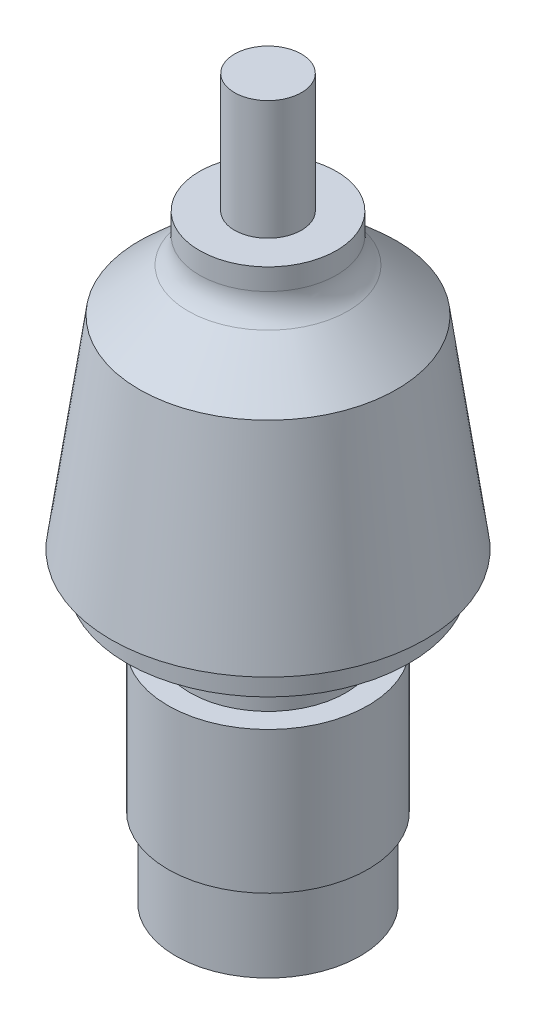
ISO-10303-21;
HEADER;
FILE_DESCRIPTION(('STEP AP214'),'2;1');
FILE_NAME('part.step','',(''),(''),'','','');
FILE_SCHEMA(('AUTOMOTIVE_DESIGN { 1 0 10303 214 1 1 1 1 }'));
ENDSEC;
DATA;
#1=APPLICATION_CONTEXT('core data for automotive mechanical design processes');
#2=APPLICATION_PROTOCOL_DEFINITION('international standard','automotive_design',2000,#1);
#3=PRODUCT_CONTEXT('',#1,'mechanical');
#4=PRODUCT('Part','Part','',(#3));
#5=PRODUCT_RELATED_PRODUCT_CATEGORY('part','',(#4));
#6=PRODUCT_DEFINITION_FORMATION('','',#4);
#7=PRODUCT_DEFINITION_CONTEXT('part definition',#1,'design');
#8=PRODUCT_DEFINITION('design','',#6,#7);
#9=PRODUCT_DEFINITION_SHAPE('','',#8);
#10=(LENGTH_UNIT() NAMED_UNIT(*) SI_UNIT(.MILLI.,.METRE.));
#11=(NAMED_UNIT(*) PLANE_ANGLE_UNIT() SI_UNIT($,.RADIAN.));
#12=(NAMED_UNIT(*) SI_UNIT($,.STERADIAN.) SOLID_ANGLE_UNIT());
#13=UNCERTAINTY_MEASURE_WITH_UNIT(LENGTH_MEASURE(1.E-05),#10,'distance_accuracy_value','');
#14=(GEOMETRIC_REPRESENTATION_CONTEXT(3) GLOBAL_UNCERTAINTY_ASSIGNED_CONTEXT((#13)) GLOBAL_UNIT_ASSIGNED_CONTEXT((#10,
#11,#12)) REPRESENTATION_CONTEXT('',''));
#15=CARTESIAN_POINT('',(0.,0.,0.));
#16=DIRECTION('',(0.,0.,1.));
#17=DIRECTION('',(1.,0.,0.));
#18=AXIS2_PLACEMENT_3D('',#15,#16,#17);
#19=CARTESIAN_POINT('',(0.,11.7856,0.));
#20=DIRECTION('',(0.,-1.,0.));
#21=DIRECTION('',(0.,0.,-1.));
#22=AXIS2_PLACEMENT_3D('',#19,#20,#21);
#23=CYLINDRICAL_SURFACE('',#22,13.7541);
#24=CARTESIAN_POINT('',(0.,11.7856,0.));
#25=DIRECTION('',(0.,1.,0.));
#26=DIRECTION('',(0.,0.,1.));
#27=AXIS2_PLACEMENT_3D('',#24,#25,#26);
#28=CIRCLE('',#27,13.7541);
#29=CARTESIAN_POINT('',(0.,11.7856,13.7541));
#30=VERTEX_POINT('',#29);
#31=EDGE_CURVE('E48',#30,#30,#28,.T.);
#32=ORIENTED_EDGE('',*,*,#31,.F.);
#33=EDGE_LOOP('',(#32));
#34=FACE_BOUND('',#33,.T.);
#35=CARTESIAN_POINT('',(0.,0.,0.));
#36=DIRECTION('',(0.,1.,0.));
#37=DIRECTION('',(0.,0.,1.));
#38=AXIS2_PLACEMENT_3D('',#35,#36,#37);
#39=CIRCLE('',#38,13.7541);
#40=CARTESIAN_POINT('',(0.,0.,13.7541));
#41=VERTEX_POINT('',#40);
#42=EDGE_CURVE('E52',#41,#41,#39,.T.);
#43=ORIENTED_EDGE('',*,*,#42,.T.);
#44=EDGE_LOOP('',(#43));
#45=FACE_BOUND('',#44,.T.);
#46=ADVANCED_FACE('F37',(#34,#45),#23,.T.);
#47=CARTESIAN_POINT('',(0.,0.,0.));
#48=DIRECTION('',(0.,1.,0.));
#49=DIRECTION('',(0.,0.,1.));
#50=AXIS2_PLACEMENT_3D('',#47,#48,#49);
#51=PLANE('',#50);
#52=ORIENTED_EDGE('',*,*,#42,.F.);
#53=EDGE_LOOP('',(#52));
#54=FACE_BOUND('',#53,.T.);
#55=ADVANCED_FACE('F115',(#54),#51,.F.);
#56=CARTESIAN_POINT('',(0.,32.9438,0.));
#57=DIRECTION('',(0.,-1.,0.));
#58=DIRECTION('',(0.,0.,-1.));
#59=AXIS2_PLACEMENT_3D('',#56,#57,#58);
#60=CYLINDRICAL_SURFACE('',#59,14.9225);
#61=CARTESIAN_POINT('',(0.,32.9438,0.));
#62=DIRECTION('',(0.,1.,0.));
#63=DIRECTION('',(0.,0.,1.));
#64=AXIS2_PLACEMENT_3D('',#61,#62,#63);
#65=CIRCLE('',#64,14.9225);
#66=CARTESIAN_POINT('',(0.,32.9438,14.9225));
#67=VERTEX_POINT('',#66);
#68=EDGE_CURVE('E56',#67,#67,#65,.T.);
#69=ORIENTED_EDGE('',*,*,#68,.F.);
#70=EDGE_LOOP('',(#69));
#71=FACE_BOUND('',#70,.T.);
#72=CARTESIAN_POINT('',(0.,11.7856,0.));
#73=DIRECTION('',(0.,1.,0.));
#74=DIRECTION('',(0.,0.,1.));
#75=AXIS2_PLACEMENT_3D('',#72,#73,#74);
#76=CIRCLE('',#75,14.9225);
#77=CARTESIAN_POINT('',(0.,11.7856,14.9225));
#78=VERTEX_POINT('',#77);
#79=EDGE_CURVE('E58',#78,#78,#76,.T.);
#80=ORIENTED_EDGE('',*,*,#79,.T.);
#81=EDGE_LOOP('',(#80));
#82=FACE_BOUND('',#81,.T.);
#83=ADVANCED_FACE('F120',(#71,#82),#60,.T.);
#84=CARTESIAN_POINT('',(0.,32.9438,0.));
#85=DIRECTION('',(0.,1.,0.));
#86=DIRECTION('',(0.,0.,1.));
#87=AXIS2_PLACEMENT_3D('',#84,#85,#86);
#88=PLANE('',#87);
#89=CARTESIAN_POINT('',(0.,32.9438,0.));
#90=DIRECTION('',(0.,1.,0.));
#91=DIRECTION('',(0.,0.,1.));
#92=AXIS2_PLACEMENT_3D('',#89,#90,#91);
#93=CIRCLE('',#92,11.6205);
#94=CARTESIAN_POINT('',(0.,32.9438,11.6205));
#95=VERTEX_POINT('',#94);
#96=EDGE_CURVE('E64',#95,#95,#93,.T.);
#97=ORIENTED_EDGE('',*,*,#96,.F.);
#98=EDGE_LOOP('',(#97));
#99=FACE_BOUND('',#98,.T.);
#100=ORIENTED_EDGE('',*,*,#68,.T.);
#101=EDGE_LOOP('',(#100));
#102=FACE_BOUND('',#101,.T.);
#103=ADVANCED_FACE('F128',(#99,#102),#88,.T.);
#104=CARTESIAN_POINT('',(0.,11.7856,0.));
#105=DIRECTION('',(0.,1.,0.));
#106=DIRECTION('',(0.,0.,1.));
#107=AXIS2_PLACEMENT_3D('',#104,#105,#106);
#108=PLANE('',#107);
#109=ORIENTED_EDGE('',*,*,#31,.T.);
#110=EDGE_LOOP('',(#109));
#111=FACE_BOUND('',#110,.T.);
#112=ORIENTED_EDGE('',*,*,#79,.F.);
#113=EDGE_LOOP('',(#112));
#114=FACE_BOUND('',#113,.T.);
#115=ADVANCED_FACE('F130',(#111,#114),#108,.F.);
#116=CARTESIAN_POINT('',(0.,41.5036,0.));
#117=DIRECTION('',(0.,-1.,0.));
#118=DIRECTION('',(0.,0.,-1.));
#119=AXIS2_PLACEMENT_3D('',#116,#117,#118);
#120=CYLINDRICAL_SURFACE('',#119,11.6205);
#121=CARTESIAN_POINT('',(0.,41.5036,0.));
#122=DIRECTION('',(0.,1.,0.));
#123=DIRECTION('',(0.,0.,1.));
#124=AXIS2_PLACEMENT_3D('',#121,#122,#123);
#125=CIRCLE('',#124,11.6205);
#126=CARTESIAN_POINT('',(0.,41.5036,11.6205));
#127=VERTEX_POINT('',#126);
#128=EDGE_CURVE('E61',#127,#127,#125,.T.);
#129=ORIENTED_EDGE('',*,*,#128,.F.);
#130=EDGE_LOOP('',(#129));
#131=FACE_BOUND('',#130,.T.);
#132=ORIENTED_EDGE('',*,*,#96,.T.);
#133=EDGE_LOOP('',(#132));
#134=FACE_BOUND('',#133,.T.);
#135=ADVANCED_FACE('F133',(#131,#134),#120,.T.);
#136=CARTESIAN_POINT('',(0.,45.72,0.));
#137=DIRECTION('',(0.,-1.,0.));
#138=DIRECTION('',(0.,0.,-1.));
#139=AXIS2_PLACEMENT_3D('',#136,#137,#138);
#140=CYLINDRICAL_SURFACE('',#139,21.082);
#141=CARTESIAN_POINT('',(0.,45.72,0.));
#142=DIRECTION('',(0.,1.,0.));
#143=DIRECTION('',(0.,0.,1.));
#144=AXIS2_PLACEMENT_3D('',#141,#142,#143);
#145=CIRCLE('',#144,21.082);
#146=CARTESIAN_POINT('',(0.,45.72,21.082));
#147=VERTEX_POINT('',#146);
#148=EDGE_CURVE('E67',#147,#147,#145,.T.);
#149=ORIENTED_EDGE('',*,*,#148,.F.);
#150=EDGE_LOOP('',(#149));
#151=FACE_BOUND('',#150,.T.);
#152=CARTESIAN_POINT('',(0.,41.5036,0.));
#153=DIRECTION('',(0.,1.,0.));
#154=DIRECTION('',(0.,0.,1.));
#155=AXIS2_PLACEMENT_3D('',#152,#153,#154);
#156=CIRCLE('',#155,21.082);
#157=CARTESIAN_POINT('',(0.,41.5036,21.082));
#158=VERTEX_POINT('',#157);
#159=EDGE_CURVE('E70',#158,#158,#156,.T.);
#160=ORIENTED_EDGE('',*,*,#159,.T.);
#161=EDGE_LOOP('',(#160));
#162=FACE_BOUND('',#161,.T.);
#163=ADVANCED_FACE('F140',(#151,#162),#140,.T.);
#164=CARTESIAN_POINT('',(0.,41.5036,0.));
#165=DIRECTION('',(0.,1.,0.));
#166=DIRECTION('',(0.,0.,1.));
#167=AXIS2_PLACEMENT_3D('',#164,#165,#166);
#168=PLANE('',#167);
#169=ORIENTED_EDGE('',*,*,#128,.T.);
#170=EDGE_LOOP('',(#169));
#171=FACE_BOUND('',#170,.T.);
#172=ORIENTED_EDGE('',*,*,#159,.F.);
#173=EDGE_LOOP('',(#172));
#174=FACE_BOUND('',#173,.T.);
#175=ADVANCED_FACE('F144',(#171,#174),#168,.F.);
#176=CARTESIAN_POINT('',(0.,45.72,0.));
#177=DIRECTION('',(0.,1.,0.));
#178=DIRECTION('',(0.,0.,1.));
#179=AXIS2_PLACEMENT_3D('',#176,#177,#178);
#180=PLANE('',#179);
#181=ORIENTED_EDGE('',*,*,#148,.T.);
#182=EDGE_LOOP('',(#181));
#183=FACE_BOUND('',#182,.T.);
#184=CARTESIAN_POINT('',(0.,45.72,0.));
#185=DIRECTION('',(0.,1.,0.));
#186=DIRECTION('',(0.,0.,1.));
#187=AXIS2_PLACEMENT_3D('',#184,#185,#186);
#188=CIRCLE('',#187,23.4315);
#189=CARTESIAN_POINT('',(0.,45.72,23.4315));
#190=VERTEX_POINT('',#189);
#191=EDGE_CURVE('E73',#190,#190,#188,.T.);
#192=ORIENTED_EDGE('',*,*,#191,.F.);
#193=EDGE_LOOP('',(#192));
#194=FACE_BOUND('',#193,.T.);
#195=ADVANCED_FACE('F148',(#183,#194),#180,.F.);
#196=CARTESIAN_POINT('',(0.,75.9206,0.));
#197=DIRECTION('',(0.,-1.,0.));
#198=DIRECTION('',(0.,0.,-1.));
#199=AXIS2_PLACEMENT_3D('',#196,#197,#198);
#200=CONICAL_SURFACE('',#199,19.2024,0.13912893634311);
#201=CARTESIAN_POINT('',(0.,75.9206,0.));
#202=DIRECTION('',(0.,1.,0.));
#203=DIRECTION('',(0.,0.,1.));
#204=AXIS2_PLACEMENT_3D('',#201,#202,#203);
#205=CIRCLE('',#204,19.2024);
#206=CARTESIAN_POINT('',(0.,75.9206,19.2024));
#207=VERTEX_POINT('',#206);
#208=EDGE_CURVE('E78',#207,#207,#205,.T.);
#209=ORIENTED_EDGE('',*,*,#208,.F.);
#210=EDGE_LOOP('',(#209));
#211=FACE_BOUND('',#210,.T.);
#212=ORIENTED_EDGE('',*,*,#191,.T.);
#213=EDGE_LOOP('',(#212));
#214=FACE_BOUND('',#213,.T.);
#215=ADVANCED_FACE('F112',(#211,#214),#200,.T.);
#216=CARTESIAN_POINT('',(0.,83.9216,0.));
#217=DIRECTION('',(0.,-1.,0.));
#218=DIRECTION('',(0.,0.,-1.));
#219=AXIS2_PLACEMENT_3D('',#216,#217,#218);
#220=CONICAL_SURFACE('',#219,10.2235,0.842926239645957);
#221=CARTESIAN_POINT('',(0.,82.4064164170985,0.));
#222=DIRECTION('',(0.,1.,0.));
#223=DIRECTION('',(0.,0.,1.));
#224=AXIS2_PLACEMENT_3D('',#221,#222,#223);
#225=CIRCLE('',#224,11.9238726874783);
#226=CARTESIAN_POINT('',(0.,82.4064164170985,11.9238726874783));
#227=VERTEX_POINT('',#226);
#228=EDGE_CURVE('E11',#227,#227,#225,.F.);
#229=ORIENTED_EDGE('',*,*,#228,.T.);
#230=EDGE_LOOP('',(#229));
#231=FACE_BOUND('',#230,.T.);
#232=ORIENTED_EDGE('',*,*,#208,.T.);
#233=EDGE_LOOP('',(#232));
#234=FACE_BOUND('',#233,.T.);
#235=ADVANCED_FACE('F107',(#231,#234),#220,.T.);
#236=CARTESIAN_POINT('',(0.,89.3826,0.));
#237=DIRECTION('',(0.,-1.,0.));
#238=DIRECTION('',(0.,0.,-1.));
#239=AXIS2_PLACEMENT_3D('',#236,#237,#238);
#240=CYLINDRICAL_SURFACE('',#239,10.2235);
#241=CARTESIAN_POINT('',(0.,86.1991092900395,0.));
#242=DIRECTION('',(0.,1.,0.));
#243=DIRECTION('',(0.,0.,1.));
#244=AXIS2_PLACEMENT_3D('',#241,#242,#243);
#245=CIRCLE('',#244,10.2235);
#246=CARTESIAN_POINT('',(0.,86.1991092900395,10.2235));
#247=VERTEX_POINT('',#246);
#248=EDGE_CURVE('E44',#247,#247,#245,.T.);
#249=ORIENTED_EDGE('',*,*,#248,.T.);
#250=EDGE_LOOP('',(#249));
#251=FACE_BOUND('',#250,.T.);
#252=CARTESIAN_POINT('',(0.,89.3826,0.));
#253=DIRECTION('',(0.,1.,0.));
#254=DIRECTION('',(0.,0.,1.));
#255=AXIS2_PLACEMENT_3D('',#252,#253,#254);
#256=CIRCLE('',#255,10.2235);
#257=CARTESIAN_POINT('',(0.,89.3826,10.2235));
#258=VERTEX_POINT('',#257);
#259=EDGE_CURVE('E81',#258,#258,#256,.T.);
#260=ORIENTED_EDGE('',*,*,#259,.F.);
#261=EDGE_LOOP('',(#260));
#262=FACE_BOUND('',#261,.T.);
#263=ADVANCED_FACE('F102',(#251,#262),#240,.T.);
#264=CARTESIAN_POINT('',(0.,89.3826,0.));
#265=DIRECTION('',(0.,1.,0.));
#266=DIRECTION('',(0.,0.,1.));
#267=AXIS2_PLACEMENT_3D('',#264,#265,#266);
#268=PLANE('',#267);
#269=CARTESIAN_POINT('',(0.,89.3826,0.));
#270=DIRECTION('',(0.,1.,0.));
#271=DIRECTION('',(0.,0.,1.));
#272=AXIS2_PLACEMENT_3D('',#269,#270,#271);
#273=CIRCLE('',#272,4.9911);
#274=CARTESIAN_POINT('',(0.,89.3826,4.9911));
#275=VERTEX_POINT('',#274);
#276=EDGE_CURVE('E85',#275,#275,#273,.T.);
#277=ORIENTED_EDGE('',*,*,#276,.F.);
#278=EDGE_LOOP('',(#277));
#279=FACE_BOUND('',#278,.T.);
#280=ORIENTED_EDGE('',*,*,#259,.T.);
#281=EDGE_LOOP('',(#280));
#282=FACE_BOUND('',#281,.T.);
#283=ADVANCED_FACE('F96',(#279,#282),#268,.T.);
#284=CARTESIAN_POINT('',(0.,107.1626,0.));
#285=DIRECTION('',(0.,-1.,0.));
#286=DIRECTION('',(0.,0.,-1.));
#287=AXIS2_PLACEMENT_3D('',#284,#285,#286);
#288=CYLINDRICAL_SURFACE('',#287,4.9911);
#289=CARTESIAN_POINT('',(0.,107.1626,0.));
#290=DIRECTION('',(0.,1.,0.));
#291=DIRECTION('',(0.,0.,1.));
#292=AXIS2_PLACEMENT_3D('',#289,#290,#291);
#293=CIRCLE('',#292,4.9911);
#294=CARTESIAN_POINT('',(0.,107.1626,4.9911));
#295=VERTEX_POINT('',#294);
#296=EDGE_CURVE('E84',#295,#295,#293,.T.);
#297=ORIENTED_EDGE('',*,*,#296,.F.);
#298=EDGE_LOOP('',(#297));
#299=FACE_BOUND('',#298,.T.);
#300=ORIENTED_EDGE('',*,*,#276,.T.);
#301=EDGE_LOOP('',(#300));
#302=FACE_BOUND('',#301,.T.);
#303=ADVANCED_FACE('F93',(#299,#302),#288,.T.);
#304=CARTESIAN_POINT('',(0.,107.1626,0.));
#305=DIRECTION('',(0.,1.,0.));
#306=DIRECTION('',(0.,0.,1.));
#307=AXIS2_PLACEMENT_3D('',#304,#305,#306);
#308=PLANE('',#307);
#309=ORIENTED_EDGE('',*,*,#296,.T.);
#310=EDGE_LOOP('',(#309));
#311=FACE_BOUND('',#310,.T.);
#312=ADVANCED_FACE('F91',(#311),#308,.T.);
#313=CARTESIAN_POINT('',(0.,86.1991092900395,0.));
#314=DIRECTION('',(0.,1.,0.));
#315=DIRECTION('',(0.,0.,1.));
#316=AXIS2_PLACEMENT_3D('',#313,#314,#315);
#317=TOROIDAL_SURFACE('',#316,15.3035,5.08);
#318=ORIENTED_EDGE('',*,*,#228,.F.);
#319=EDGE_LOOP('',(#318));
#320=FACE_BOUND('',#319,.T.);
#321=ORIENTED_EDGE('',*,*,#248,.F.);
#322=EDGE_LOOP('',(#321));
#323=FACE_BOUND('',#322,.T.);
#324=ADVANCED_FACE('F39',(#320,#323),#317,.F.);
#325=CLOSED_SHELL('',(#46,#55,#83,#103,#115,#135,#163,#175,#195,#215,#235,#263,#283,#303,#312,#324));
#326=MANIFOLD_SOLID_BREP('B2',#325);
#327=ADVANCED_BREP_SHAPE_REPRESENTATION('',(#18,#326),#14);
#328=SHAPE_DEFINITION_REPRESENTATION(#9,#327);
ENDSEC;
END-ISO-10303-21;
